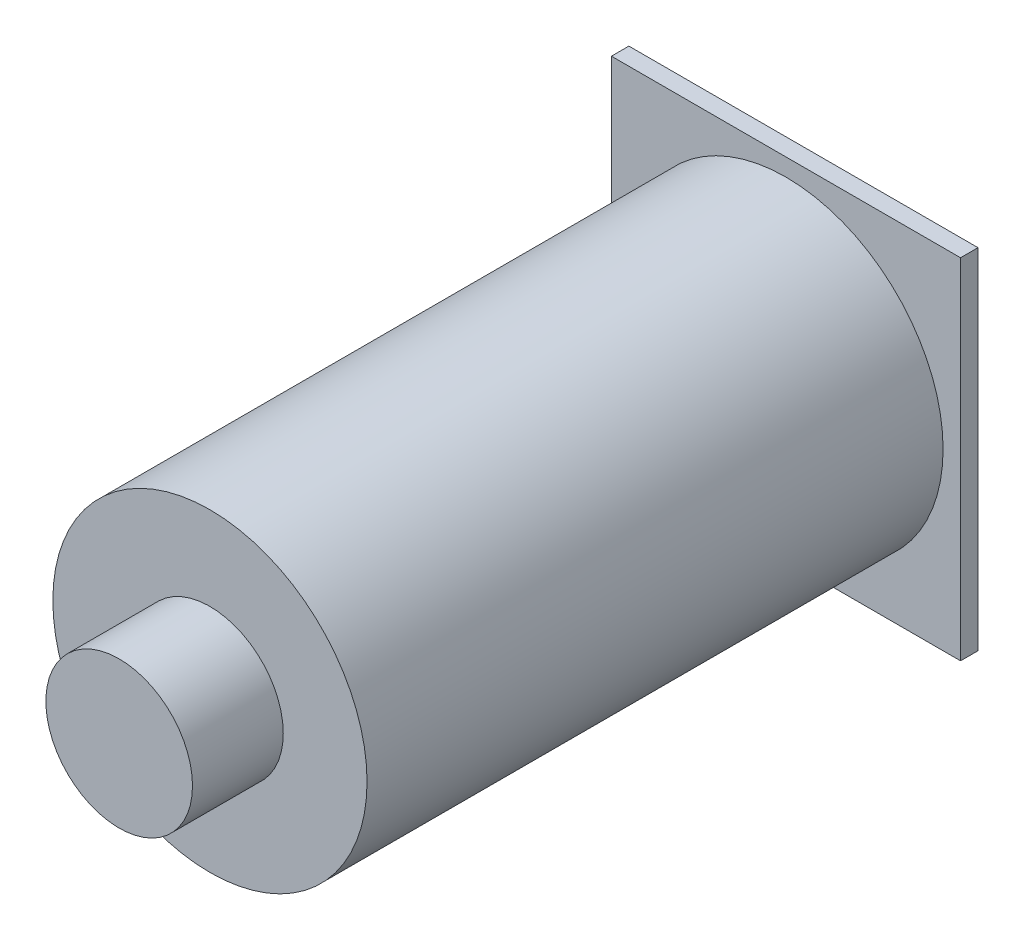
ISO-10303-21;
HEADER;
FILE_DESCRIPTION(('STEP AP214'),'2;1');
FILE_NAME('part.step','',(''),(''),'','','');
FILE_SCHEMA(('AUTOMOTIVE_DESIGN { 1 0 10303 214 1 1 1 1 }'));
ENDSEC;
DATA;
#1=APPLICATION_CONTEXT('core data for automotive mechanical design processes');
#2=APPLICATION_PROTOCOL_DEFINITION('international standard','automotive_design',2000,#1);
#3=PRODUCT_CONTEXT('',#1,'mechanical');
#4=PRODUCT('Part','Part','',(#3));
#5=PRODUCT_RELATED_PRODUCT_CATEGORY('part','',(#4));
#6=PRODUCT_DEFINITION_FORMATION('','',#4);
#7=PRODUCT_DEFINITION_CONTEXT('part definition',#1,'design');
#8=PRODUCT_DEFINITION('design','',#6,#7);
#9=PRODUCT_DEFINITION_SHAPE('','',#8);
#10=(LENGTH_UNIT() NAMED_UNIT(*) SI_UNIT(.MILLI.,.METRE.));
#11=(NAMED_UNIT(*) PLANE_ANGLE_UNIT() SI_UNIT($,.RADIAN.));
#12=(NAMED_UNIT(*) SI_UNIT($,.STERADIAN.) SOLID_ANGLE_UNIT());
#13=UNCERTAINTY_MEASURE_WITH_UNIT(LENGTH_MEASURE(1.E-05),#10,'distance_accuracy_value','');
#14=(GEOMETRIC_REPRESENTATION_CONTEXT(3) GLOBAL_UNCERTAINTY_ASSIGNED_CONTEXT((#13)) GLOBAL_UNIT_ASSIGNED_CONTEXT((#10,
#11,#12)) REPRESENTATION_CONTEXT('',''));
#15=CARTESIAN_POINT('',(0.,0.,0.));
#16=DIRECTION('',(0.,0.,1.));
#17=DIRECTION('',(1.,0.,0.));
#18=AXIS2_PLACEMENT_3D('',#15,#16,#17);
#19=CARTESIAN_POINT('',(0.,0.,215.9));
#20=DIRECTION('',(0.,0.,1.));
#21=DIRECTION('',(1.,0.,0.));
#22=AXIS2_PLACEMENT_3D('',#19,#20,#21);
#23=PLANE('',#22);
#24=CARTESIAN_POINT('',(0.,0.,215.9));
#25=DIRECTION('',(0.,0.,1.));
#26=DIRECTION('',(1.,0.,0.));
#27=AXIS2_PLACEMENT_3D('',#24,#25,#26);
#28=CIRCLE('',#27,57.15);
#29=CARTESIAN_POINT('',(57.15,0.,215.9));
#30=VERTEX_POINT('',#29);
#31=EDGE_CURVE('E104',#30,#30,#28,.T.);
#32=ORIENTED_EDGE('',*,*,#31,.T.);
#33=EDGE_LOOP('',(#32));
#34=FACE_BOUND('',#33,.T.);
#35=CARTESIAN_POINT('',(0.,0.,215.9));
#36=DIRECTION('',(0.,0.,1.));
#37=DIRECTION('',(1.,0.,0.));
#38=AXIS2_PLACEMENT_3D('',#35,#36,#37);
#39=CIRCLE('',#38,26.67);
#40=CARTESIAN_POINT('',(26.67,0.,215.9));
#41=VERTEX_POINT('',#40);
#42=EDGE_CURVE('E146',#41,#41,#39,.T.);
#43=ORIENTED_EDGE('',*,*,#42,.F.);
#44=EDGE_LOOP('',(#43));
#45=FACE_BOUND('',#44,.T.);
#46=ADVANCED_FACE('F33',(#34,#45),#23,.T.);
#47=CARTESIAN_POINT('',(63.5,63.5,6.35));
#48=DIRECTION('',(0.,0.,-1.));
#49=DIRECTION('',(-1.,0.,0.));
#50=AXIS2_PLACEMENT_3D('',#47,#48,#49);
#51=PLANE('',#50);
#52=DIRECTION('',(0.,1.,0.));
#53=VECTOR('',#52,1.);
#54=CARTESIAN_POINT('',(63.5,-63.5,6.35));
#55=LINE('',#54,#53);
#56=CARTESIAN_POINT('',(63.5,-63.5,6.35));
#57=VERTEX_POINT('',#56);
#58=CARTESIAN_POINT('',(63.5,63.5,6.35));
#59=VERTEX_POINT('',#58);
#60=EDGE_CURVE('E87',#57,#59,#55,.T.);
#61=ORIENTED_EDGE('',*,*,#60,.T.);
#62=DIRECTION('',(-1.,0.,0.));
#63=VECTOR('',#62,1.);
#64=CARTESIAN_POINT('',(-63.5,63.5,6.35));
#65=LINE('',#64,#63);
#66=CARTESIAN_POINT('',(-63.5,63.5,6.35));
#67=VERTEX_POINT('',#66);
#68=EDGE_CURVE('E81',#59,#67,#65,.T.);
#69=ORIENTED_EDGE('',*,*,#68,.T.);
#70=DIRECTION('',(0.,-1.,0.));
#71=VECTOR('',#70,1.);
#72=CARTESIAN_POINT('',(-63.5,-63.5,6.35));
#73=LINE('',#72,#71);
#74=CARTESIAN_POINT('',(-63.5,-63.5,6.35));
#75=VERTEX_POINT('',#74);
#76=EDGE_CURVE('E85',#67,#75,#73,.T.);
#77=ORIENTED_EDGE('',*,*,#76,.T.);
#78=DIRECTION('',(1.,0.,0.));
#79=VECTOR('',#78,1.);
#80=CARTESIAN_POINT('',(-63.5,-63.5,6.35));
#81=LINE('',#80,#79);
#82=EDGE_CURVE('E50',#75,#57,#81,.T.);
#83=ORIENTED_EDGE('',*,*,#82,.T.);
#84=EDGE_LOOP('',(#61,#69,#77,#83));
#85=FACE_BOUND('',#84,.T.);
#86=CARTESIAN_POINT('',(0.,0.,6.34999999999999));
#87=DIRECTION('',(0.,0.,-1.));
#88=DIRECTION('',(-1.,0.,0.));
#89=AXIS2_PLACEMENT_3D('',#86,#87,#88);
#90=CIRCLE('',#89,57.15);
#91=CARTESIAN_POINT('',(-57.15,0.,6.34999999999999));
#92=VERTEX_POINT('',#91);
#93=EDGE_CURVE('E11',#92,#92,#90,.F.);
#94=ORIENTED_EDGE('',*,*,#93,.F.);
#95=EDGE_LOOP('',(#94));
#96=FACE_BOUND('',#95,.T.);
#97=ADVANCED_FACE('F82',(#85,#96),#51,.F.);
#98=CARTESIAN_POINT('',(63.5,-63.5,6.35));
#99=DIRECTION('',(-1.,0.,0.));
#100=DIRECTION('',(0.,0.,1.));
#101=AXIS2_PLACEMENT_3D('',#98,#99,#100);
#102=PLANE('',#101);
#103=DIRECTION('',(0.,1.,0.));
#104=VECTOR('',#103,1.);
#105=CARTESIAN_POINT('',(63.5,-63.5,0.));
#106=LINE('',#105,#104);
#107=CARTESIAN_POINT('',(63.5,-63.5,0.));
#108=VERTEX_POINT('',#107);
#109=CARTESIAN_POINT('',(63.5,63.5,0.));
#110=VERTEX_POINT('',#109);
#111=EDGE_CURVE('E101',#108,#110,#106,.T.);
#112=ORIENTED_EDGE('',*,*,#111,.T.);
#113=DIRECTION('',(0.,0.,-1.));
#114=VECTOR('',#113,1.);
#115=CARTESIAN_POINT('',(63.5,63.5,6.35));
#116=LINE('',#115,#114);
#117=EDGE_CURVE('E42',#59,#110,#116,.T.);
#118=ORIENTED_EDGE('',*,*,#117,.F.);
#119=ORIENTED_EDGE('',*,*,#60,.F.);
#120=DIRECTION('',(0.,0.,-1.));
#121=VECTOR('',#120,1.);
#122=CARTESIAN_POINT('',(63.5,-63.5,6.35));
#123=LINE('',#122,#121);
#124=EDGE_CURVE('E97',#57,#108,#123,.T.);
#125=ORIENTED_EDGE('',*,*,#124,.T.);
#126=EDGE_LOOP('',(#112,#118,#119,#125));
#127=FACE_BOUND('',#126,.T.);
#128=ADVANCED_FACE('F35',(#127),#102,.F.);
#129=CARTESIAN_POINT('',(-63.5,63.5,6.35));
#130=DIRECTION('',(0.,-1.,0.));
#131=DIRECTION('',(0.,0.,-1.));
#132=AXIS2_PLACEMENT_3D('',#129,#130,#131);
#133=PLANE('',#132);
#134=DIRECTION('',(-1.,0.,0.));
#135=VECTOR('',#134,1.);
#136=CARTESIAN_POINT('',(-63.5,63.5,0.));
#137=LINE('',#136,#135);
#138=CARTESIAN_POINT('',(-63.5,63.5,0.));
#139=VERTEX_POINT('',#138);
#140=EDGE_CURVE('E92',#110,#139,#137,.T.);
#141=ORIENTED_EDGE('',*,*,#140,.T.);
#142=DIRECTION('',(0.,0.,-1.));
#143=VECTOR('',#142,1.);
#144=CARTESIAN_POINT('',(-63.5,63.5,6.35));
#145=LINE('',#144,#143);
#146=EDGE_CURVE('E90',#67,#139,#145,.T.);
#147=ORIENTED_EDGE('',*,*,#146,.F.);
#148=ORIENTED_EDGE('',*,*,#68,.F.);
#149=ORIENTED_EDGE('',*,*,#117,.T.);
#150=EDGE_LOOP('',(#141,#147,#148,#149));
#151=FACE_BOUND('',#150,.T.);
#152=ADVANCED_FACE('F91',(#151),#133,.F.);
#153=CARTESIAN_POINT('',(-63.5,-63.5,6.35));
#154=DIRECTION('',(1.,0.,0.));
#155=DIRECTION('',(0.,0.,-1.));
#156=AXIS2_PLACEMENT_3D('',#153,#154,#155);
#157=PLANE('',#156);
#158=DIRECTION('',(0.,-1.,0.));
#159=VECTOR('',#158,1.);
#160=CARTESIAN_POINT('',(-63.5,-63.5,0.));
#161=LINE('',#160,#159);
#162=CARTESIAN_POINT('',(-63.5,-63.5,0.));
#163=VERTEX_POINT('',#162);
#164=EDGE_CURVE('E67',#139,#163,#161,.T.);
#165=ORIENTED_EDGE('',*,*,#164,.T.);
#166=DIRECTION('',(0.,0.,-1.));
#167=VECTOR('',#166,1.);
#168=CARTESIAN_POINT('',(-63.5,-63.5,6.35));
#169=LINE('',#168,#167);
#170=EDGE_CURVE('E93',#75,#163,#169,.T.);
#171=ORIENTED_EDGE('',*,*,#170,.F.);
#172=ORIENTED_EDGE('',*,*,#76,.F.);
#173=ORIENTED_EDGE('',*,*,#146,.T.);
#174=EDGE_LOOP('',(#165,#171,#172,#173));
#175=FACE_BOUND('',#174,.T.);
#176=ADVANCED_FACE('F95',(#175),#157,.F.);
#177=CARTESIAN_POINT('',(-63.5,-63.5,6.35));
#178=DIRECTION('',(0.,1.,0.));
#179=DIRECTION('',(0.,0.,1.));
#180=AXIS2_PLACEMENT_3D('',#177,#178,#179);
#181=PLANE('',#180);
#182=DIRECTION('',(1.,0.,0.));
#183=VECTOR('',#182,1.);
#184=CARTESIAN_POINT('',(-63.5,-63.5,0.));
#185=LINE('',#184,#183);
#186=EDGE_CURVE('E73',#163,#108,#185,.T.);
#187=ORIENTED_EDGE('',*,*,#186,.T.);
#188=ORIENTED_EDGE('',*,*,#124,.F.);
#189=ORIENTED_EDGE('',*,*,#82,.F.);
#190=ORIENTED_EDGE('',*,*,#170,.T.);
#191=EDGE_LOOP('',(#187,#188,#189,#190));
#192=FACE_BOUND('',#191,.T.);
#193=ADVANCED_FACE('F115',(#192),#181,.F.);
#194=CARTESIAN_POINT('',(63.5,63.5,0.));
#195=DIRECTION('',(0.,0.,-1.));
#196=DIRECTION('',(-1.,0.,0.));
#197=AXIS2_PLACEMENT_3D('',#194,#195,#196);
#198=PLANE('',#197);
#199=ORIENTED_EDGE('',*,*,#111,.F.);
#200=ORIENTED_EDGE('',*,*,#186,.F.);
#201=ORIENTED_EDGE('',*,*,#164,.F.);
#202=ORIENTED_EDGE('',*,*,#140,.F.);
#203=EDGE_LOOP('',(#199,#200,#201,#202));
#204=FACE_BOUND('',#203,.T.);
#205=ADVANCED_FACE('F112',(#204),#198,.T.);
#206=CARTESIAN_POINT('',(0.,0.,215.9));
#207=DIRECTION('',(0.,0.,-1.));
#208=DIRECTION('',(-1.,0.,0.));
#209=AXIS2_PLACEMENT_3D('',#206,#207,#208);
#210=CYLINDRICAL_SURFACE('',#209,57.15);
#211=ORIENTED_EDGE('',*,*,#31,.F.);
#212=EDGE_LOOP('',(#211));
#213=FACE_BOUND('',#212,.T.);
#214=ORIENTED_EDGE('',*,*,#93,.T.);
#215=EDGE_LOOP('',(#214));
#216=FACE_BOUND('',#215,.T.);
#217=ADVANCED_FACE('F114',(#213,#216),#210,.T.);
#218=CARTESIAN_POINT('',(0.,0.,248.92));
#219=DIRECTION('',(0.,0.,-1.));
#220=DIRECTION('',(-1.,0.,0.));
#221=AXIS2_PLACEMENT_3D('',#218,#219,#220);
#222=CYLINDRICAL_SURFACE('',#221,26.67);
#223=CARTESIAN_POINT('',(0.,0.,248.92));
#224=DIRECTION('',(0.,0.,1.));
#225=DIRECTION('',(1.,0.,0.));
#226=AXIS2_PLACEMENT_3D('',#223,#224,#225);
#227=CIRCLE('',#226,26.67);
#228=CARTESIAN_POINT('',(26.67,0.,248.92));
#229=VERTEX_POINT('',#228);
#230=EDGE_CURVE('E145',#229,#229,#227,.T.);
#231=ORIENTED_EDGE('',*,*,#230,.F.);
#232=EDGE_LOOP('',(#231));
#233=FACE_BOUND('',#232,.T.);
#234=ORIENTED_EDGE('',*,*,#42,.T.);
#235=EDGE_LOOP('',(#234));
#236=FACE_BOUND('',#235,.T.);
#237=ADVANCED_FACE('F121',(#233,#236),#222,.T.);
#238=CARTESIAN_POINT('',(0.,0.,248.92));
#239=DIRECTION('',(0.,0.,1.));
#240=DIRECTION('',(1.,0.,0.));
#241=AXIS2_PLACEMENT_3D('',#238,#239,#240);
#242=PLANE('',#241);
#243=ORIENTED_EDGE('',*,*,#230,.T.);
#244=EDGE_LOOP('',(#243));
#245=FACE_BOUND('',#244,.T.);
#246=ADVANCED_FACE('F137',(#245),#242,.T.);
#247=CLOSED_SHELL('',(#46,#97,#128,#152,#176,#193,#205,#217,#237,#246));
#248=MANIFOLD_SOLID_BREP('B2',#247);
#249=ADVANCED_BREP_SHAPE_REPRESENTATION('',(#18,#248),#14);
#250=SHAPE_DEFINITION_REPRESENTATION(#9,#249);
ENDSEC;
END-ISO-10303-21;
